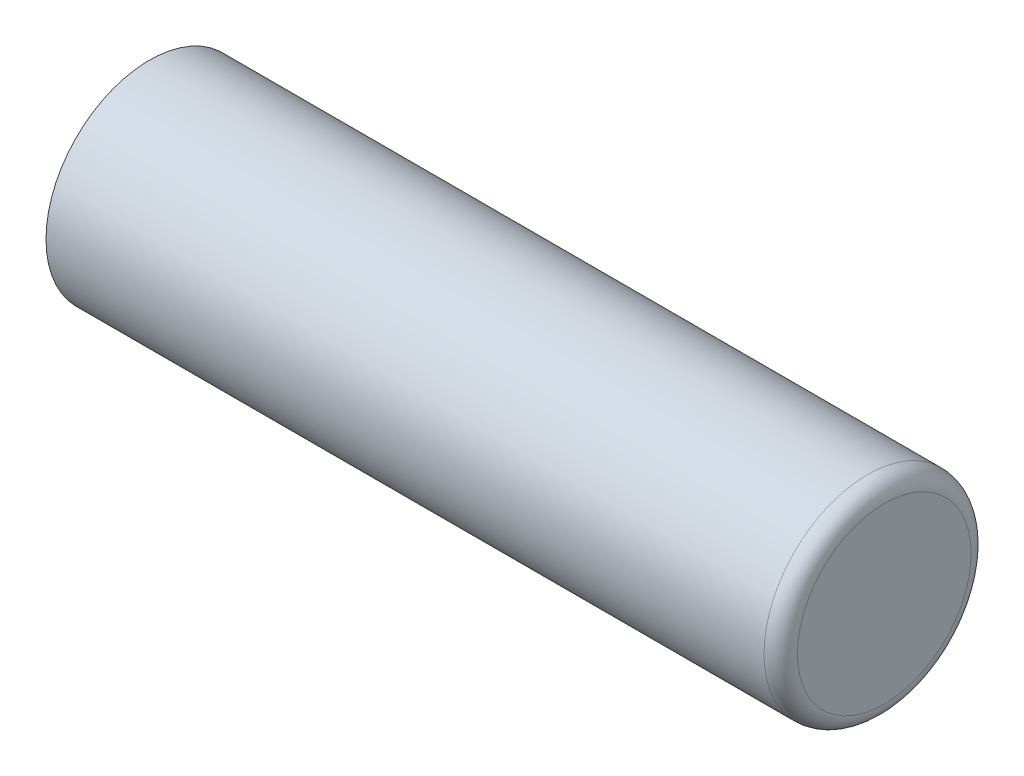
ISO-10303-21;
HEADER;
FILE_DESCRIPTION(('STEP AP214'),'2;1');
FILE_NAME('part.step','',(''),(''),'','','');
FILE_SCHEMA(('AUTOMOTIVE_DESIGN { 1 0 10303 214 1 1 1 1 }'));
ENDSEC;
DATA;
#1=APPLICATION_CONTEXT('core data for automotive mechanical design processes');
#2=APPLICATION_PROTOCOL_DEFINITION('international standard','automotive_design',2000,#1);
#3=PRODUCT_CONTEXT('',#1,'mechanical');
#4=PRODUCT('Part','Part','',(#3));
#5=PRODUCT_RELATED_PRODUCT_CATEGORY('part','',(#4));
#6=PRODUCT_DEFINITION_FORMATION('','',#4);
#7=PRODUCT_DEFINITION_CONTEXT('part definition',#1,'design');
#8=PRODUCT_DEFINITION('design','',#6,#7);
#9=PRODUCT_DEFINITION_SHAPE('','',#8);
#10=(LENGTH_UNIT() NAMED_UNIT(*) SI_UNIT(.MILLI.,.METRE.));
#11=(NAMED_UNIT(*) PLANE_ANGLE_UNIT() SI_UNIT($,.RADIAN.));
#12=(NAMED_UNIT(*) SI_UNIT($,.STERADIAN.) SOLID_ANGLE_UNIT());
#13=UNCERTAINTY_MEASURE_WITH_UNIT(LENGTH_MEASURE(1.E-05),#10,'distance_accuracy_value','');
#14=(GEOMETRIC_REPRESENTATION_CONTEXT(3) GLOBAL_UNCERTAINTY_ASSIGNED_CONTEXT((#13)) GLOBAL_UNIT_ASSIGNED_CONTEXT((#10,
#11,#12)) REPRESENTATION_CONTEXT('',''));
#15=CARTESIAN_POINT('',(0.,0.,0.));
#16=DIRECTION('',(0.,0.,1.));
#17=DIRECTION('',(1.,0.,0.));
#18=AXIS2_PLACEMENT_3D('',#15,#16,#17);
#19=CARTESIAN_POINT('',(11.,0.,-2.60000000000001));
#20=DIRECTION('',(-1.,0.,0.));
#21=DIRECTION('',(0.,0.,1.));
#22=AXIS2_PLACEMENT_3D('',#19,#20,#21);
#23=PLANE('',#22);
#24=CARTESIAN_POINT('',(11.,0.,0.));
#25=DIRECTION('',(-1.,0.,0.));
#26=DIRECTION('',(0.,0.,1.));
#27=AXIS2_PLACEMENT_3D('',#24,#25,#26);
#28=CIRCLE('',#27,2.60000000000001);
#29=CARTESIAN_POINT('',(11.,0.,2.60000000000001));
#30=VERTEX_POINT('',#29);
#31=EDGE_CURVE('E38',#30,#30,#28,.T.);
#32=ORIENTED_EDGE('',*,*,#31,.F.);
#33=EDGE_LOOP('',(#32));
#34=FACE_BOUND('',#33,.T.);
#35=ADVANCED_FACE('F28',(#34),#23,.F.);
#36=CARTESIAN_POINT('',(-11.,0.,-3.10000000000001));
#37=DIRECTION('',(1.,0.,0.));
#38=DIRECTION('',(0.,0.,-1.));
#39=AXIS2_PLACEMENT_3D('',#36,#37,#38);
#40=PLANE('',#39);
#41=CARTESIAN_POINT('',(-11.,0.,0.));
#42=DIRECTION('',(-1.,0.,0.));
#43=DIRECTION('',(0.,0.,1.));
#44=AXIS2_PLACEMENT_3D('',#41,#42,#43);
#45=CIRCLE('',#44,3.10000000000001);
#46=CARTESIAN_POINT('',(-11.,0.,3.10000000000001));
#47=VERTEX_POINT('',#46);
#48=EDGE_CURVE('E10',#47,#47,#45,.T.);
#49=ORIENTED_EDGE('',*,*,#48,.T.);
#50=EDGE_LOOP('',(#49));
#51=FACE_BOUND('',#50,.T.);
#52=ADVANCED_FACE('F48',(#51),#40,.F.);
#53=CARTESIAN_POINT('',(-11.,0.,0.));
#54=DIRECTION('',(-1.,0.,0.));
#55=DIRECTION('',(0.,0.,1.));
#56=AXIS2_PLACEMENT_3D('',#53,#54,#55);
#57=CYLINDRICAL_SURFACE('',#56,3.10000000000001);
#58=ORIENTED_EDGE('',*,*,#48,.F.);
#59=EDGE_LOOP('',(#58));
#60=FACE_BOUND('',#59,.T.);
#61=CARTESIAN_POINT('',(10.5,0.,0.));
#62=DIRECTION('',(-1.,0.,0.));
#63=DIRECTION('',(0.,0.,1.));
#64=AXIS2_PLACEMENT_3D('',#61,#62,#63);
#65=CIRCLE('',#64,3.10000000000001);
#66=CARTESIAN_POINT('',(10.5,0.,3.10000000000001));
#67=VERTEX_POINT('',#66);
#68=EDGE_CURVE('E34',#67,#67,#65,.T.);
#69=ORIENTED_EDGE('',*,*,#68,.T.);
#70=EDGE_LOOP('',(#69));
#71=FACE_BOUND('',#70,.T.);
#72=ADVANCED_FACE('F52',(#60,#71),#57,.T.);
#73=CARTESIAN_POINT('',(10.5,0.,0.));
#74=DIRECTION('',(-1.,0.,0.));
#75=DIRECTION('',(0.,0.,1.));
#76=AXIS2_PLACEMENT_3D('',#73,#74,#75);
#77=TOROIDAL_SURFACE('',#76,2.60000000000001,0.5);
#78=ORIENTED_EDGE('',*,*,#68,.F.);
#79=EDGE_LOOP('',(#78));
#80=FACE_BOUND('',#79,.T.);
#81=ORIENTED_EDGE('',*,*,#31,.T.);
#82=EDGE_LOOP('',(#81));
#83=FACE_BOUND('',#82,.T.);
#84=ADVANCED_FACE('F45',(#80,#83),#77,.T.);
#85=CLOSED_SHELL('',(#35,#52,#72,#84));
#86=MANIFOLD_SOLID_BREP('B2',#85);
#87=ADVANCED_BREP_SHAPE_REPRESENTATION('',(#18,#86),#14);
#88=SHAPE_DEFINITION_REPRESENTATION(#9,#87);
ENDSEC;
END-ISO-10303-21;
